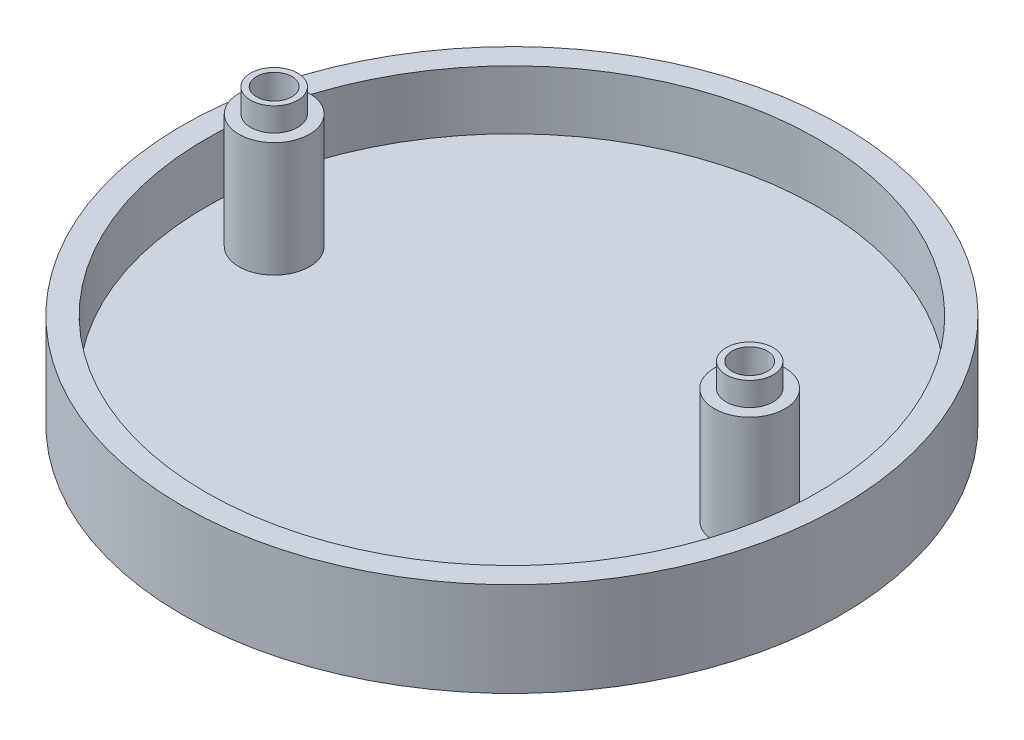
ISO-10303-21;
HEADER;
FILE_DESCRIPTION(('STEP AP214'),'2;1');
FILE_NAME('part.step','',(''),(''),'','','');
FILE_SCHEMA(('AUTOMOTIVE_DESIGN { 1 0 10303 214 1 1 1 1 }'));
ENDSEC;
DATA;
#1=APPLICATION_CONTEXT('core data for automotive mechanical design processes');
#2=APPLICATION_PROTOCOL_DEFINITION('international standard','automotive_design',2000,#1);
#3=PRODUCT_CONTEXT('',#1,'mechanical');
#4=PRODUCT('Part','Part','',(#3));
#5=PRODUCT_RELATED_PRODUCT_CATEGORY('part','',(#4));
#6=PRODUCT_DEFINITION_FORMATION('','',#4);
#7=PRODUCT_DEFINITION_CONTEXT('part definition',#1,'design');
#8=PRODUCT_DEFINITION('design','',#6,#7);
#9=PRODUCT_DEFINITION_SHAPE('','',#8);
#10=(LENGTH_UNIT() NAMED_UNIT(*) SI_UNIT(.MILLI.,.METRE.));
#11=(NAMED_UNIT(*) PLANE_ANGLE_UNIT() SI_UNIT($,.RADIAN.));
#12=(NAMED_UNIT(*) SI_UNIT($,.STERADIAN.) SOLID_ANGLE_UNIT());
#13=UNCERTAINTY_MEASURE_WITH_UNIT(LENGTH_MEASURE(1.E-05),#10,'distance_accuracy_value','');
#14=(GEOMETRIC_REPRESENTATION_CONTEXT(3) GLOBAL_UNCERTAINTY_ASSIGNED_CONTEXT((#13)) GLOBAL_UNIT_ASSIGNED_CONTEXT((#10,
#11,#12)) REPRESENTATION_CONTEXT('',''));
#15=CARTESIAN_POINT('',(0.,0.,0.));
#16=DIRECTION('',(0.,0.,1.));
#17=DIRECTION('',(1.,0.,0.));
#18=AXIS2_PLACEMENT_3D('',#15,#16,#17);
#19=CARTESIAN_POINT('',(0.,0.,0.));
#20=DIRECTION('',(0.,1.,0.));
#21=DIRECTION('',(0.,0.,1.));
#22=AXIS2_PLACEMENT_3D('',#19,#20,#21);
#23=PLANE('',#22);
#24=CARTESIAN_POINT('',(0.,0.,0.));
#25=DIRECTION('',(0.,1.,0.));
#26=DIRECTION('',(0.,0.,1.));
#27=AXIS2_PLACEMENT_3D('',#24,#25,#26);
#28=CIRCLE('',#27,28.);
#29=CARTESIAN_POINT('',(0.,0.,28.));
#30=VERTEX_POINT('',#29);
#31=EDGE_CURVE('E99',#30,#30,#28,.T.);
#32=ORIENTED_EDGE('',*,*,#31,.F.);
#33=EDGE_LOOP('',(#32));
#34=FACE_BOUND('',#33,.T.);
#35=CARTESIAN_POINT('',(20.2,0.,0.));
#36=DIRECTION('',(0.,-1.,0.));
#37=DIRECTION('',(0.,0.,-1.));
#38=AXIS2_PLACEMENT_3D('',#35,#36,#37);
#39=CIRCLE('',#38,2.5);
#40=CARTESIAN_POINT('',(20.2,0.,-2.5));
#41=VERTEX_POINT('',#40);
#42=EDGE_CURVE('E67',#41,#41,#39,.T.);
#43=ORIENTED_EDGE('',*,*,#42,.F.);
#44=EDGE_LOOP('',(#43));
#45=FACE_BOUND('',#44,.T.);
#46=CARTESIAN_POINT('',(-20.2,0.,0.));
#47=DIRECTION('',(0.,1.,0.));
#48=DIRECTION('',(0.,0.,1.));
#49=AXIS2_PLACEMENT_3D('',#46,#47,#48);
#50=CIRCLE('',#49,2.5);
#51=CARTESIAN_POINT('',(-20.2,0.,2.5));
#52=VERTEX_POINT('',#51);
#53=EDGE_CURVE('E62',#52,#52,#50,.T.);
#54=ORIENTED_EDGE('',*,*,#53,.T.);
#55=EDGE_LOOP('',(#54));
#56=FACE_BOUND('',#55,.T.);
#57=ADVANCED_FACE('F33',(#34,#45,#56),#23,.F.);
#58=CARTESIAN_POINT('',(20.2,-15.25,0.));
#59=DIRECTION('',(0.,1.,0.));
#60=DIRECTION('',(0.,0.,1.));
#61=AXIS2_PLACEMENT_3D('',#58,#59,#60);
#62=CYLINDRICAL_SURFACE('',#61,1.5);
#63=CARTESIAN_POINT('',(20.2,14.75,0.));
#64=DIRECTION('',(0.,1.,0.));
#65=DIRECTION('',(0.,0.,1.));
#66=AXIS2_PLACEMENT_3D('',#63,#64,#65);
#67=CIRCLE('',#66,1.5);
#68=CARTESIAN_POINT('',(20.2,14.75,1.5));
#69=VERTEX_POINT('',#68);
#70=EDGE_CURVE('E75',#69,#69,#67,.T.);
#71=ORIENTED_EDGE('',*,*,#70,.T.);
#72=EDGE_LOOP('',(#71));
#73=FACE_BOUND('',#72,.T.);
#74=CARTESIAN_POINT('',(20.2,1.,0.));
#75=DIRECTION('',(0.,-1.,0.));
#76=DIRECTION('',(0.,0.,-1.));
#77=AXIS2_PLACEMENT_3D('',#74,#75,#76);
#78=CIRCLE('',#77,1.5);
#79=CARTESIAN_POINT('',(20.2,1.,-1.5));
#80=VERTEX_POINT('',#79);
#81=EDGE_CURVE('E54',#80,#80,#78,.F.);
#82=ORIENTED_EDGE('',*,*,#81,.F.);
#83=EDGE_LOOP('',(#82));
#84=FACE_BOUND('',#83,.T.);
#85=ADVANCED_FACE('F107',(#73,#84),#62,.F.);
#86=CARTESIAN_POINT('',(0.,8.,0.));
#87=DIRECTION('',(0.,1.,0.));
#88=DIRECTION('',(0.,0.,1.));
#89=AXIS2_PLACEMENT_3D('',#86,#87,#88);
#90=PLANE('',#89);
#91=CARTESIAN_POINT('',(0.,8.,0.));
#92=DIRECTION('',(0.,1.,0.));
#93=DIRECTION('',(0.,0.,1.));
#94=AXIS2_PLACEMENT_3D('',#91,#92,#93);
#95=CIRCLE('',#94,28.);
#96=CARTESIAN_POINT('',(0.,8.,28.));
#97=VERTEX_POINT('',#96);
#98=EDGE_CURVE('E46',#97,#97,#95,.T.);
#99=ORIENTED_EDGE('',*,*,#98,.T.);
#100=EDGE_LOOP('',(#99));
#101=FACE_BOUND('',#100,.T.);
#102=CARTESIAN_POINT('',(0.,8.,0.));
#103=DIRECTION('',(0.,1.,0.));
#104=DIRECTION('',(0.,0.,1.));
#105=AXIS2_PLACEMENT_3D('',#102,#103,#104);
#106=CIRCLE('',#105,26.);
#107=CARTESIAN_POINT('',(0.,8.,26.));
#108=VERTEX_POINT('',#107);
#109=EDGE_CURVE('E96',#108,#108,#106,.T.);
#110=ORIENTED_EDGE('',*,*,#109,.F.);
#111=EDGE_LOOP('',(#110));
#112=FACE_BOUND('',#111,.T.);
#113=ADVANCED_FACE('F133',(#101,#112),#90,.T.);
#114=CARTESIAN_POINT('',(0.,8.,0.));
#115=DIRECTION('',(0.,-1.,0.));
#116=DIRECTION('',(0.,0.,-1.));
#117=AXIS2_PLACEMENT_3D('',#114,#115,#116);
#118=CYLINDRICAL_SURFACE('',#117,28.);
#119=ORIENTED_EDGE('',*,*,#98,.F.);
#120=EDGE_LOOP('',(#119));
#121=FACE_BOUND('',#120,.T.);
#122=ORIENTED_EDGE('',*,*,#31,.T.);
#123=EDGE_LOOP('',(#122));
#124=FACE_BOUND('',#123,.T.);
#125=ADVANCED_FACE('F35',(#121,#124),#118,.T.);
#126=CARTESIAN_POINT('',(0.,8.,0.));
#127=DIRECTION('',(0.,-1.,0.));
#128=DIRECTION('',(0.,0.,-1.));
#129=AXIS2_PLACEMENT_3D('',#126,#127,#128);
#130=CYLINDRICAL_SURFACE('',#129,26.);
#131=CARTESIAN_POINT('',(0.,3.,0.));
#132=DIRECTION('',(0.,1.,0.));
#133=DIRECTION('',(0.,0.,1.));
#134=AXIS2_PLACEMENT_3D('',#131,#132,#133);
#135=CIRCLE('',#134,26.);
#136=CARTESIAN_POINT('',(0.,3.,26.));
#137=VERTEX_POINT('',#136);
#138=EDGE_CURVE('E41',#137,#137,#135,.T.);
#139=ORIENTED_EDGE('',*,*,#138,.F.);
#140=EDGE_LOOP('',(#139));
#141=FACE_BOUND('',#140,.T.);
#142=ORIENTED_EDGE('',*,*,#109,.T.);
#143=EDGE_LOOP('',(#142));
#144=FACE_BOUND('',#143,.T.);
#145=ADVANCED_FACE('F172',(#141,#144),#130,.F.);
#146=CARTESIAN_POINT('',(0.,3.,0.));
#147=DIRECTION('',(0.,1.,0.));
#148=DIRECTION('',(0.,0.,1.));
#149=AXIS2_PLACEMENT_3D('',#146,#147,#148);
#150=PLANE('',#149);
#151=CARTESIAN_POINT('',(-20.2,3.,0.));
#152=DIRECTION('',(0.,1.,0.));
#153=DIRECTION('',(0.,0.,-1.));
#154=AXIS2_PLACEMENT_3D('',#151,#152,#153);
#155=CIRCLE('',#154,3.);
#156=CARTESIAN_POINT('',(-20.2,3.,-2.99999999999999));
#157=VERTEX_POINT('',#156);
#158=EDGE_CURVE('E78',#157,#157,#155,.T.);
#159=ORIENTED_EDGE('',*,*,#158,.F.);
#160=EDGE_LOOP('',(#159));
#161=FACE_BOUND('',#160,.T.);
#162=CARTESIAN_POINT('',(20.2,3.,0.));
#163=DIRECTION('',(0.,1.,0.));
#164=DIRECTION('',(0.,0.,1.));
#165=AXIS2_PLACEMENT_3D('',#162,#163,#164);
#166=CIRCLE('',#165,3.);
#167=CARTESIAN_POINT('',(20.2,3.,3.));
#168=VERTEX_POINT('',#167);
#169=EDGE_CURVE('E52',#168,#168,#166,.T.);
#170=ORIENTED_EDGE('',*,*,#169,.F.);
#171=EDGE_LOOP('',(#170));
#172=FACE_BOUND('',#171,.T.);
#173=ORIENTED_EDGE('',*,*,#138,.T.);
#174=EDGE_LOOP('',(#173));
#175=FACE_BOUND('',#174,.T.);
#176=ADVANCED_FACE('F156',(#161,#172,#175),#150,.T.);
#177=CARTESIAN_POINT('',(20.2,12.75,0.));
#178=DIRECTION('',(0.,-1.,0.));
#179=DIRECTION('',(0.,0.,-1.));
#180=AXIS2_PLACEMENT_3D('',#177,#178,#179);
#181=CYLINDRICAL_SURFACE('',#180,3.);
#182=CARTESIAN_POINT('',(20.2,12.75,0.));
#183=DIRECTION('',(0.,1.,0.));
#184=DIRECTION('',(0.,0.,1.));
#185=AXIS2_PLACEMENT_3D('',#182,#183,#184);
#186=CIRCLE('',#185,3.);
#187=CARTESIAN_POINT('',(20.2,12.75,3.));
#188=VERTEX_POINT('',#187);
#189=EDGE_CURVE('E85',#188,#188,#186,.T.);
#190=ORIENTED_EDGE('',*,*,#189,.F.);
#191=EDGE_LOOP('',(#190));
#192=FACE_BOUND('',#191,.T.);
#193=ORIENTED_EDGE('',*,*,#169,.T.);
#194=EDGE_LOOP('',(#193));
#195=FACE_BOUND('',#194,.T.);
#196=ADVANCED_FACE('F153',(#192,#195),#181,.T.);
#197=CARTESIAN_POINT('',(20.2,12.75,0.));
#198=DIRECTION('',(0.,1.,0.));
#199=DIRECTION('',(0.,0.,1.));
#200=AXIS2_PLACEMENT_3D('',#197,#198,#199);
#201=PLANE('',#200);
#202=CARTESIAN_POINT('',(20.2,12.75,0.));
#203=DIRECTION('',(0.,1.,0.));
#204=DIRECTION('',(0.,0.,1.));
#205=AXIS2_PLACEMENT_3D('',#202,#203,#204);
#206=CIRCLE('',#205,2.);
#207=CARTESIAN_POINT('',(20.2,12.75,2.));
#208=VERTEX_POINT('',#207);
#209=EDGE_CURVE('E10',#208,#208,#206,.F.);
#210=ORIENTED_EDGE('',*,*,#209,.T.);
#211=EDGE_LOOP('',(#210));
#212=FACE_BOUND('',#211,.T.);
#213=ORIENTED_EDGE('',*,*,#189,.T.);
#214=EDGE_LOOP('',(#213));
#215=FACE_BOUND('',#214,.T.);
#216=ADVANCED_FACE('F149',(#212,#215),#201,.T.);
#217=CARTESIAN_POINT('',(20.2,14.75,0.));
#218=DIRECTION('',(0.,-1.,0.));
#219=DIRECTION('',(0.,0.,-1.));
#220=AXIS2_PLACEMENT_3D('',#217,#218,#219);
#221=PLANE('',#220);
#222=ORIENTED_EDGE('',*,*,#70,.F.);
#223=EDGE_LOOP('',(#222));
#224=FACE_BOUND('',#223,.T.);
#225=CARTESIAN_POINT('',(20.2,14.75,0.));
#226=DIRECTION('',(0.,1.,0.));
#227=DIRECTION('',(0.,0.,-1.));
#228=AXIS2_PLACEMENT_3D('',#225,#226,#227);
#229=CIRCLE('',#228,2.);
#230=CARTESIAN_POINT('',(20.2,14.75,-2.));
#231=VERTEX_POINT('',#230);
#232=EDGE_CURVE('E93',#231,#231,#229,.T.);
#233=ORIENTED_EDGE('',*,*,#232,.T.);
#234=EDGE_LOOP('',(#233));
#235=FACE_BOUND('',#234,.T.);
#236=ADVANCED_FACE('F152',(#224,#235),#221,.F.);
#237=CARTESIAN_POINT('',(20.2,0.5,0.));
#238=DIRECTION('',(0.,1.,0.));
#239=DIRECTION('',(0.,0.,1.));
#240=AXIS2_PLACEMENT_3D('',#237,#238,#239);
#241=CYLINDRICAL_SURFACE('',#240,2.);
#242=ORIENTED_EDGE('',*,*,#209,.F.);
#243=EDGE_LOOP('',(#242));
#244=FACE_BOUND('',#243,.T.);
#245=ORIENTED_EDGE('',*,*,#232,.F.);
#246=EDGE_LOOP('',(#245));
#247=FACE_BOUND('',#246,.T.);
#248=ADVANCED_FACE('F147',(#244,#247),#241,.T.);
#249=CARTESIAN_POINT('',(-20.2,12.75,0.));
#250=DIRECTION('',(0.,-1.,0.));
#251=DIRECTION('',(0.,0.,-1.));
#252=AXIS2_PLACEMENT_3D('',#249,#250,#251);
#253=CYLINDRICAL_SURFACE('',#252,3.);
#254=CARTESIAN_POINT('',(-20.2,12.75,0.));
#255=DIRECTION('',(0.,1.,0.));
#256=DIRECTION('',(0.,0.,-1.));
#257=AXIS2_PLACEMENT_3D('',#254,#255,#256);
#258=CIRCLE('',#257,3.);
#259=CARTESIAN_POINT('',(-20.2,12.75,-2.99999999999999));
#260=VERTEX_POINT('',#259);
#261=EDGE_CURVE('E53',#260,#260,#258,.T.);
#262=ORIENTED_EDGE('',*,*,#261,.F.);
#263=EDGE_LOOP('',(#262));
#264=FACE_BOUND('',#263,.T.);
#265=ORIENTED_EDGE('',*,*,#158,.T.);
#266=EDGE_LOOP('',(#265));
#267=FACE_BOUND('',#266,.T.);
#268=ADVANCED_FACE('F143',(#264,#267),#253,.T.);
#269=CARTESIAN_POINT('',(-20.2,12.75,0.));
#270=DIRECTION('',(0.,-1.,0.));
#271=DIRECTION('',(0.,0.,-1.));
#272=AXIS2_PLACEMENT_3D('',#269,#270,#271);
#273=PLANE('',#272);
#274=CARTESIAN_POINT('',(-20.2,12.75,0.));
#275=DIRECTION('',(0.,-1.,0.));
#276=DIRECTION('',(0.,0.,-1.));
#277=AXIS2_PLACEMENT_3D('',#274,#275,#276);
#278=CIRCLE('',#277,2.);
#279=CARTESIAN_POINT('',(-20.2,12.75,-2.));
#280=VERTEX_POINT('',#279);
#281=EDGE_CURVE('E50',#280,#280,#278,.F.);
#282=ORIENTED_EDGE('',*,*,#281,.F.);
#283=EDGE_LOOP('',(#282));
#284=FACE_BOUND('',#283,.T.);
#285=ORIENTED_EDGE('',*,*,#261,.T.);
#286=EDGE_LOOP('',(#285));
#287=FACE_BOUND('',#286,.T.);
#288=ADVANCED_FACE('F139',(#284,#287),#273,.F.);
#289=CARTESIAN_POINT('',(-20.2,14.75,0.));
#290=DIRECTION('',(0.,1.,0.));
#291=DIRECTION('',(0.,0.,1.));
#292=AXIS2_PLACEMENT_3D('',#289,#290,#291);
#293=PLANE('',#292);
#294=CARTESIAN_POINT('',(-20.2,14.75,0.));
#295=DIRECTION('',(0.,1.,0.));
#296=DIRECTION('',(0.,0.,-1.));
#297=AXIS2_PLACEMENT_3D('',#294,#295,#296);
#298=CIRCLE('',#297,1.5);
#299=CARTESIAN_POINT('',(-20.2,14.75,-1.5));
#300=VERTEX_POINT('',#299);
#301=EDGE_CURVE('E60',#300,#300,#298,.T.);
#302=ORIENTED_EDGE('',*,*,#301,.F.);
#303=EDGE_LOOP('',(#302));
#304=FACE_BOUND('',#303,.T.);
#305=CARTESIAN_POINT('',(-20.2,14.75,0.));
#306=DIRECTION('',(0.,1.,0.));
#307=DIRECTION('',(0.,0.,1.));
#308=AXIS2_PLACEMENT_3D('',#305,#306,#307);
#309=CIRCLE('',#308,2.);
#310=CARTESIAN_POINT('',(-20.2,14.75,2.));
#311=VERTEX_POINT('',#310);
#312=EDGE_CURVE('E88',#311,#311,#309,.T.);
#313=ORIENTED_EDGE('',*,*,#312,.T.);
#314=EDGE_LOOP('',(#313));
#315=FACE_BOUND('',#314,.T.);
#316=ADVANCED_FACE('F142',(#304,#315),#293,.T.);
#317=CARTESIAN_POINT('',(-20.2,0.5,0.));
#318=DIRECTION('',(0.,1.,0.));
#319=DIRECTION('',(0.,0.,1.));
#320=AXIS2_PLACEMENT_3D('',#317,#318,#319);
#321=CYLINDRICAL_SURFACE('',#320,2.);
#322=ORIENTED_EDGE('',*,*,#312,.F.);
#323=EDGE_LOOP('',(#322));
#324=FACE_BOUND('',#323,.T.);
#325=ORIENTED_EDGE('',*,*,#281,.T.);
#326=EDGE_LOOP('',(#325));
#327=FACE_BOUND('',#326,.T.);
#328=ADVANCED_FACE('F137',(#324,#327),#321,.T.);
#329=CARTESIAN_POINT('',(-20.2,-15.25,0.));
#330=DIRECTION('',(0.,1.,0.));
#331=DIRECTION('',(0.,0.,1.));
#332=AXIS2_PLACEMENT_3D('',#329,#330,#331);
#333=CYLINDRICAL_SURFACE('',#332,1.5);
#334=CARTESIAN_POINT('',(-20.2,1.,0.));
#335=DIRECTION('',(0.,1.,0.));
#336=DIRECTION('',(0.,0.,1.));
#337=AXIS2_PLACEMENT_3D('',#334,#335,#336);
#338=CIRCLE('',#337,1.5);
#339=CARTESIAN_POINT('',(-20.2,1.,1.5));
#340=VERTEX_POINT('',#339);
#341=EDGE_CURVE('E37',#340,#340,#338,.F.);
#342=ORIENTED_EDGE('',*,*,#341,.T.);
#343=EDGE_LOOP('',(#342));
#344=FACE_BOUND('',#343,.T.);
#345=ORIENTED_EDGE('',*,*,#301,.T.);
#346=EDGE_LOOP('',(#345));
#347=FACE_BOUND('',#346,.T.);
#348=ADVANCED_FACE('F129',(#344,#347),#333,.F.);
#349=CARTESIAN_POINT('',(20.2,1.,0.));
#350=DIRECTION('',(0.,-1.,0.));
#351=DIRECTION('',(0.,0.,-1.));
#352=AXIS2_PLACEMENT_3D('',#349,#350,#351);
#353=PLANE('',#352);
#354=CARTESIAN_POINT('',(20.2,1.,0.));
#355=DIRECTION('',(0.,-1.,0.));
#356=DIRECTION('',(0.,0.,-1.));
#357=AXIS2_PLACEMENT_3D('',#354,#355,#356);
#358=CIRCLE('',#357,2.5);
#359=CARTESIAN_POINT('',(20.2,1.,-2.5));
#360=VERTEX_POINT('',#359);
#361=EDGE_CURVE('E72',#360,#360,#358,.T.);
#362=ORIENTED_EDGE('',*,*,#361,.T.);
#363=EDGE_LOOP('',(#362));
#364=FACE_BOUND('',#363,.T.);
#365=ORIENTED_EDGE('',*,*,#81,.T.);
#366=EDGE_LOOP('',(#365));
#367=FACE_BOUND('',#366,.T.);
#368=ADVANCED_FACE('F125',(#364,#367),#353,.T.);
#369=CARTESIAN_POINT('',(20.2,1.,0.));
#370=DIRECTION('',(0.,-1.,0.));
#371=DIRECTION('',(0.,0.,-1.));
#372=AXIS2_PLACEMENT_3D('',#369,#370,#371);
#373=CYLINDRICAL_SURFACE('',#372,2.5);
#374=ORIENTED_EDGE('',*,*,#361,.F.);
#375=EDGE_LOOP('',(#374));
#376=FACE_BOUND('',#375,.T.);
#377=ORIENTED_EDGE('',*,*,#42,.T.);
#378=EDGE_LOOP('',(#377));
#379=FACE_BOUND('',#378,.T.);
#380=ADVANCED_FACE('F119',(#376,#379),#373,.F.);
#381=CARTESIAN_POINT('',(-20.2,1.,0.));
#382=DIRECTION('',(0.,1.,0.));
#383=DIRECTION('',(0.,0.,1.));
#384=AXIS2_PLACEMENT_3D('',#381,#382,#383);
#385=PLANE('',#384);
#386=CARTESIAN_POINT('',(-20.2,1.,0.));
#387=DIRECTION('',(0.,1.,0.));
#388=DIRECTION('',(0.,0.,1.));
#389=AXIS2_PLACEMENT_3D('',#386,#387,#388);
#390=CIRCLE('',#389,2.5);
#391=CARTESIAN_POINT('',(-20.2,1.,2.5));
#392=VERTEX_POINT('',#391);
#393=EDGE_CURVE('E56',#392,#392,#390,.T.);
#394=ORIENTED_EDGE('',*,*,#393,.F.);
#395=EDGE_LOOP('',(#394));
#396=FACE_BOUND('',#395,.T.);
#397=ORIENTED_EDGE('',*,*,#341,.F.);
#398=EDGE_LOOP('',(#397));
#399=FACE_BOUND('',#398,.T.);
#400=ADVANCED_FACE('F114',(#396,#399),#385,.F.);
#401=CARTESIAN_POINT('',(-20.2,1.,0.));
#402=DIRECTION('',(0.,-1.,0.));
#403=DIRECTION('',(0.,0.,-1.));
#404=AXIS2_PLACEMENT_3D('',#401,#402,#403);
#405=CYLINDRICAL_SURFACE('',#404,2.5);
#406=ORIENTED_EDGE('',*,*,#393,.T.);
#407=EDGE_LOOP('',(#406));
#408=FACE_BOUND('',#407,.T.);
#409=ORIENTED_EDGE('',*,*,#53,.F.);
#410=EDGE_LOOP('',(#409));
#411=FACE_BOUND('',#410,.T.);
#412=ADVANCED_FACE('F112',(#408,#411),#405,.F.);
#413=CLOSED_SHELL('',(#57,#85,#113,#125,#145,#176,#196,#216,#236,#248,#268,#288,#316,#328,#348,
#368,#380,#400,#412));
#414=MANIFOLD_SOLID_BREP('B2',#413);
#415=ADVANCED_BREP_SHAPE_REPRESENTATION('',(#18,#414),#14);
#416=SHAPE_DEFINITION_REPRESENTATION(#9,#415);
ENDSEC;
END-ISO-10303-21;
